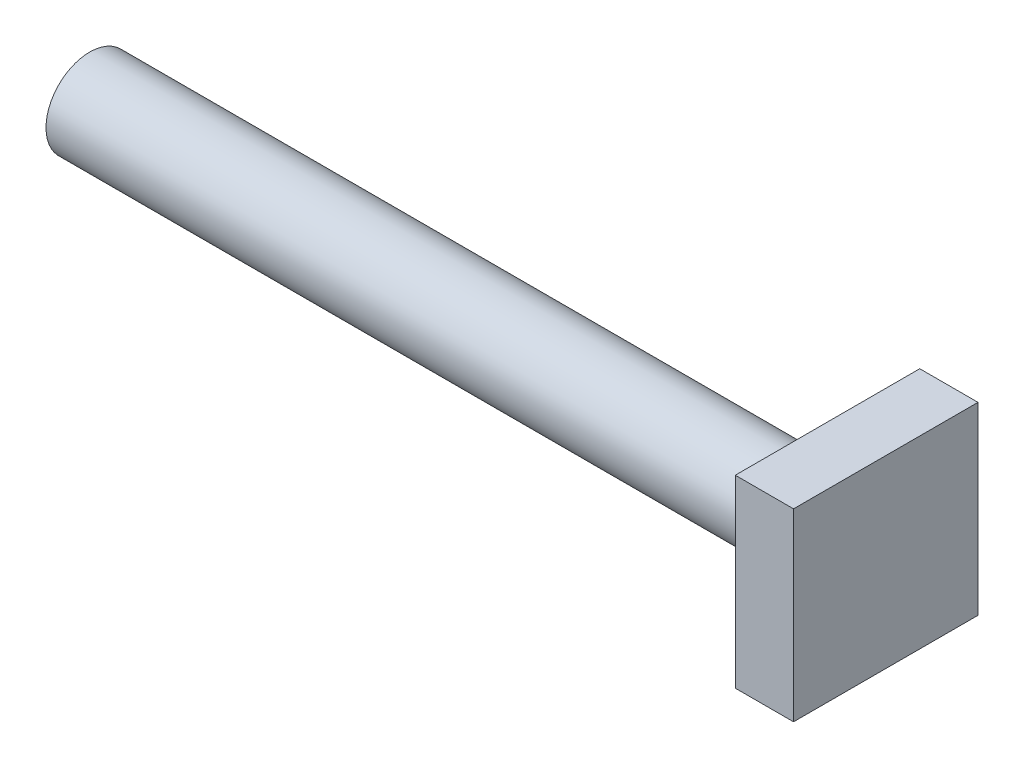
ISO-10303-21;
HEADER;
FILE_DESCRIPTION(('STEP AP214'),'2;1');
FILE_NAME('part.step','',(''),(''),'','','');
FILE_SCHEMA(('AUTOMOTIVE_DESIGN { 1 0 10303 214 1 1 1 1 }'));
ENDSEC;
DATA;
#1=APPLICATION_CONTEXT('core data for automotive mechanical design processes');
#2=APPLICATION_PROTOCOL_DEFINITION('international standard','automotive_design',2000,#1);
#3=PRODUCT_CONTEXT('',#1,'mechanical');
#4=PRODUCT('Part','Part','',(#3));
#5=PRODUCT_RELATED_PRODUCT_CATEGORY('part','',(#4));
#6=PRODUCT_DEFINITION_FORMATION('','',#4);
#7=PRODUCT_DEFINITION_CONTEXT('part definition',#1,'design');
#8=PRODUCT_DEFINITION('design','',#6,#7);
#9=PRODUCT_DEFINITION_SHAPE('','',#8);
#10=(LENGTH_UNIT() NAMED_UNIT(*) SI_UNIT(.MILLI.,.METRE.));
#11=(NAMED_UNIT(*) PLANE_ANGLE_UNIT() SI_UNIT($,.RADIAN.));
#12=(NAMED_UNIT(*) SI_UNIT($,.STERADIAN.) SOLID_ANGLE_UNIT());
#13=UNCERTAINTY_MEASURE_WITH_UNIT(LENGTH_MEASURE(1.E-05),#10,'distance_accuracy_value','');
#14=(GEOMETRIC_REPRESENTATION_CONTEXT(3) GLOBAL_UNCERTAINTY_ASSIGNED_CONTEXT((#13)) GLOBAL_UNIT_ASSIGNED_CONTEXT((#10,
#11,#12)) REPRESENTATION_CONTEXT('',''));
#15=CARTESIAN_POINT('',(0.,0.,0.));
#16=DIRECTION('',(0.,0.,1.));
#17=DIRECTION('',(1.,0.,0.));
#18=AXIS2_PLACEMENT_3D('',#15,#16,#17);
#19=CARTESIAN_POINT('',(6.,0.,0.));
#20=DIRECTION('',(0.,0.,-1.));
#21=DIRECTION('',(-1.,0.,0.));
#22=AXIS2_PLACEMENT_3D('',#19,#20,#21);
#23=PLANE('',#22);
#24=DIRECTION('',(0.,-1.,0.));
#25=VECTOR('',#24,1.);
#26=CARTESIAN_POINT('',(0.,0.,0.));
#27=LINE('',#26,#25);
#28=CARTESIAN_POINT('',(0.,19.,0.));
#29=VERTEX_POINT('',#28);
#30=CARTESIAN_POINT('',(0.,0.,0.));
#31=VERTEX_POINT('',#30);
#32=EDGE_CURVE('E96',#29,#31,#27,.T.);
#33=ORIENTED_EDGE('',*,*,#32,.T.);
#34=DIRECTION('',(-1.,0.,0.));
#35=VECTOR('',#34,1.);
#36=CARTESIAN_POINT('',(6.,0.,0.));
#37=LINE('',#36,#35);
#38=CARTESIAN_POINT('',(6.,0.,0.));
#39=VERTEX_POINT('',#38);
#40=EDGE_CURVE('E11',#39,#31,#37,.T.);
#41=ORIENTED_EDGE('',*,*,#40,.F.);
#42=DIRECTION('',(0.,-1.,0.));
#43=VECTOR('',#42,1.);
#44=CARTESIAN_POINT('',(6.,0.,0.));
#45=LINE('',#44,#43);
#46=CARTESIAN_POINT('',(6.,19.,0.));
#47=VERTEX_POINT('',#46);
#48=EDGE_CURVE('E84',#47,#39,#45,.T.);
#49=ORIENTED_EDGE('',*,*,#48,.F.);
#50=DIRECTION('',(-1.,0.,0.));
#51=VECTOR('',#50,1.);
#52=CARTESIAN_POINT('',(6.,19.,0.));
#53=LINE('',#52,#51);
#54=EDGE_CURVE('E92',#47,#29,#53,.T.);
#55=ORIENTED_EDGE('',*,*,#54,.T.);
#56=EDGE_LOOP('',(#33,#41,#49,#55));
#57=FACE_BOUND('',#56,.T.);
#58=ADVANCED_FACE('F33',(#57),#23,.F.);
#59=CARTESIAN_POINT('',(6.,0.,0.));
#60=DIRECTION('',(0.,1.,0.));
#61=DIRECTION('',(0.,0.,1.));
#62=AXIS2_PLACEMENT_3D('',#59,#60,#61);
#63=PLANE('',#62);
#64=DIRECTION('',(0.,0.,-1.));
#65=VECTOR('',#64,1.);
#66=CARTESIAN_POINT('',(0.,0.,0.));
#67=LINE('',#66,#65);
#68=CARTESIAN_POINT('',(0.,0.,-19.));
#69=VERTEX_POINT('',#68);
#70=EDGE_CURVE('E88',#31,#69,#67,.T.);
#71=ORIENTED_EDGE('',*,*,#70,.T.);
#72=DIRECTION('',(-1.,0.,0.));
#73=VECTOR('',#72,1.);
#74=CARTESIAN_POINT('',(6.,0.,-19.));
#75=LINE('',#74,#73);
#76=CARTESIAN_POINT('',(6.,0.,-19.));
#77=VERTEX_POINT('',#76);
#78=EDGE_CURVE('E41',#77,#69,#75,.T.);
#79=ORIENTED_EDGE('',*,*,#78,.F.);
#80=DIRECTION('',(0.,0.,-1.));
#81=VECTOR('',#80,1.);
#82=CARTESIAN_POINT('',(6.,0.,0.));
#83=LINE('',#82,#81);
#84=EDGE_CURVE('E79',#39,#77,#83,.T.);
#85=ORIENTED_EDGE('',*,*,#84,.F.);
#86=ORIENTED_EDGE('',*,*,#40,.T.);
#87=EDGE_LOOP('',(#71,#79,#85,#86));
#88=FACE_BOUND('',#87,.T.);
#89=ADVANCED_FACE('F87',(#88),#63,.F.);
#90=CARTESIAN_POINT('',(6.,0.,-19.));
#91=DIRECTION('',(0.,0.,1.));
#92=DIRECTION('',(1.,0.,0.));
#93=AXIS2_PLACEMENT_3D('',#90,#91,#92);
#94=PLANE('',#93);
#95=DIRECTION('',(0.,1.,0.));
#96=VECTOR('',#95,1.);
#97=CARTESIAN_POINT('',(0.,0.,-19.));
#98=LINE('',#97,#96);
#99=CARTESIAN_POINT('',(0.,19.,-19.));
#100=VERTEX_POINT('',#99);
#101=EDGE_CURVE('E66',#69,#100,#98,.T.);
#102=ORIENTED_EDGE('',*,*,#101,.T.);
#103=DIRECTION('',(-1.,0.,0.));
#104=VECTOR('',#103,1.);
#105=CARTESIAN_POINT('',(6.,19.,-19.));
#106=LINE('',#105,#104);
#107=CARTESIAN_POINT('',(6.,19.,-19.));
#108=VERTEX_POINT('',#107);
#109=EDGE_CURVE('E89',#108,#100,#106,.T.);
#110=ORIENTED_EDGE('',*,*,#109,.F.);
#111=DIRECTION('',(0.,1.,0.));
#112=VECTOR('',#111,1.);
#113=CARTESIAN_POINT('',(6.,0.,-19.));
#114=LINE('',#113,#112);
#115=EDGE_CURVE('E82',#77,#108,#114,.T.);
#116=ORIENTED_EDGE('',*,*,#115,.F.);
#117=ORIENTED_EDGE('',*,*,#78,.T.);
#118=EDGE_LOOP('',(#102,#110,#116,#117));
#119=FACE_BOUND('',#118,.T.);
#120=ADVANCED_FACE('F90',(#119),#94,.F.);
#121=CARTESIAN_POINT('',(6.,19.,0.));
#122=DIRECTION('',(0.,-1.,0.));
#123=DIRECTION('',(0.,0.,-1.));
#124=AXIS2_PLACEMENT_3D('',#121,#122,#123);
#125=PLANE('',#124);
#126=DIRECTION('',(0.,0.,1.));
#127=VECTOR('',#126,1.);
#128=CARTESIAN_POINT('',(0.,19.,0.));
#129=LINE('',#128,#127);
#130=EDGE_CURVE('E72',#100,#29,#129,.T.);
#131=ORIENTED_EDGE('',*,*,#130,.T.);
#132=ORIENTED_EDGE('',*,*,#54,.F.);
#133=DIRECTION('',(0.,0.,1.));
#134=VECTOR('',#133,1.);
#135=CARTESIAN_POINT('',(6.,19.,0.));
#136=LINE('',#135,#134);
#137=EDGE_CURVE('E49',#108,#47,#136,.T.);
#138=ORIENTED_EDGE('',*,*,#137,.F.);
#139=ORIENTED_EDGE('',*,*,#109,.T.);
#140=EDGE_LOOP('',(#131,#132,#138,#139));
#141=FACE_BOUND('',#140,.T.);
#142=ADVANCED_FACE('F104',(#141),#125,.F.);
#143=CARTESIAN_POINT('',(6.,0.,0.));
#144=DIRECTION('',(-1.,0.,0.));
#145=DIRECTION('',(0.,0.,1.));
#146=AXIS2_PLACEMENT_3D('',#143,#144,#145);
#147=PLANE('',#146);
#148=ORIENTED_EDGE('',*,*,#48,.T.);
#149=ORIENTED_EDGE('',*,*,#84,.T.);
#150=ORIENTED_EDGE('',*,*,#115,.T.);
#151=ORIENTED_EDGE('',*,*,#137,.T.);
#152=EDGE_LOOP('',(#148,#149,#150,#151));
#153=FACE_BOUND('',#152,.T.);
#154=ADVANCED_FACE('F80',(#153),#147,.F.);
#155=CARTESIAN_POINT('',(0.,0.,0.));
#156=DIRECTION('',(-1.,0.,0.));
#157=DIRECTION('',(0.,0.,1.));
#158=AXIS2_PLACEMENT_3D('',#155,#156,#157);
#159=PLANE('',#158);
#160=CARTESIAN_POINT('',(0.,9.5,-9.5));
#161=DIRECTION('',(-1.,0.,0.));
#162=DIRECTION('',(0.,0.,1.));
#163=AXIS2_PLACEMENT_3D('',#160,#161,#162);
#164=CIRCLE('',#163,4.5);
#165=CARTESIAN_POINT('',(0.,9.5,-5.));
#166=VERTEX_POINT('',#165);
#167=EDGE_CURVE('E110',#166,#166,#164,.T.);
#168=ORIENTED_EDGE('',*,*,#167,.F.);
#169=EDGE_LOOP('',(#168));
#170=FACE_BOUND('',#169,.T.);
#171=ORIENTED_EDGE('',*,*,#32,.F.);
#172=ORIENTED_EDGE('',*,*,#130,.F.);
#173=ORIENTED_EDGE('',*,*,#101,.F.);
#174=ORIENTED_EDGE('',*,*,#70,.F.);
#175=EDGE_LOOP('',(#171,#172,#173,#174));
#176=FACE_BOUND('',#175,.T.);
#177=ADVANCED_FACE('F107',(#170,#176),#159,.T.);
#178=CARTESIAN_POINT('',(-76.,9.5,-9.5));
#179=DIRECTION('',(1.,0.,0.));
#180=DIRECTION('',(0.,0.,-1.));
#181=AXIS2_PLACEMENT_3D('',#178,#179,#180);
#182=CYLINDRICAL_SURFACE('',#181,4.5);
#183=CARTESIAN_POINT('',(-76.,9.5,-9.5));
#184=DIRECTION('',(-1.,0.,0.));
#185=DIRECTION('',(0.,0.,1.));
#186=AXIS2_PLACEMENT_3D('',#183,#184,#185);
#187=CIRCLE('',#186,4.5);
#188=CARTESIAN_POINT('',(-76.,9.5,-5.));
#189=VERTEX_POINT('',#188);
#190=EDGE_CURVE('E99',#189,#189,#187,.T.);
#191=ORIENTED_EDGE('',*,*,#190,.F.);
#192=EDGE_LOOP('',(#191));
#193=FACE_BOUND('',#192,.T.);
#194=ORIENTED_EDGE('',*,*,#167,.T.);
#195=EDGE_LOOP('',(#194));
#196=FACE_BOUND('',#195,.T.);
#197=ADVANCED_FACE('F118',(#193,#196),#182,.T.);
#198=CARTESIAN_POINT('',(-76.,9.5,-9.5));
#199=DIRECTION('',(-1.,0.,0.));
#200=DIRECTION('',(0.,0.,1.));
#201=AXIS2_PLACEMENT_3D('',#198,#199,#200);
#202=PLANE('',#201);
#203=ORIENTED_EDGE('',*,*,#190,.T.);
#204=EDGE_LOOP('',(#203));
#205=FACE_BOUND('',#204,.T.);
#206=ADVANCED_FACE('F116',(#205),#202,.T.);
#207=CLOSED_SHELL('',(#58,#89,#120,#142,#154,#177,#197,#206));
#208=MANIFOLD_SOLID_BREP('B2',#207);
#209=ADVANCED_BREP_SHAPE_REPRESENTATION('',(#18,#208),#14);
#210=SHAPE_DEFINITION_REPRESENTATION(#9,#209);
ENDSEC;
END-ISO-10303-21;
